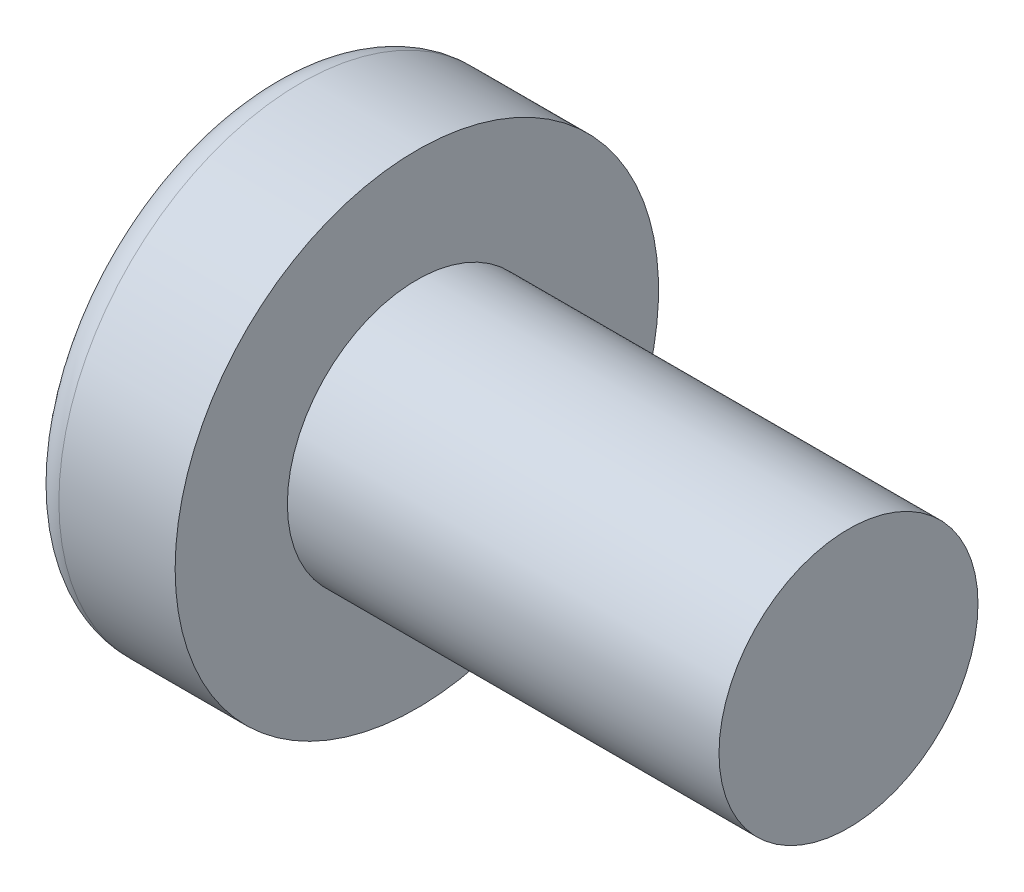
ISO-10303-21;
HEADER;
FILE_DESCRIPTION(('STEP AP214'),'2;1');
FILE_NAME('part.step','',(''),(''),'','','');
FILE_SCHEMA(('AUTOMOTIVE_DESIGN { 1 0 10303 214 1 1 1 1 }'));
ENDSEC;
DATA;
#1=APPLICATION_CONTEXT('core data for automotive mechanical design processes');
#2=APPLICATION_PROTOCOL_DEFINITION('international standard','automotive_design',2000,#1);
#3=PRODUCT_CONTEXT('',#1,'mechanical');
#4=PRODUCT('Part','Part','',(#3));
#5=PRODUCT_RELATED_PRODUCT_CATEGORY('part','',(#4));
#6=PRODUCT_DEFINITION_FORMATION('','',#4);
#7=PRODUCT_DEFINITION_CONTEXT('part definition',#1,'design');
#8=PRODUCT_DEFINITION('design','',#6,#7);
#9=PRODUCT_DEFINITION_SHAPE('','',#8);
#10=(LENGTH_UNIT() NAMED_UNIT(*) SI_UNIT(.MILLI.,.METRE.));
#11=(NAMED_UNIT(*) PLANE_ANGLE_UNIT() SI_UNIT($,.RADIAN.));
#12=(NAMED_UNIT(*) SI_UNIT($,.STERADIAN.) SOLID_ANGLE_UNIT());
#13=UNCERTAINTY_MEASURE_WITH_UNIT(LENGTH_MEASURE(1.E-05),#10,'distance_accuracy_value','');
#14=(GEOMETRIC_REPRESENTATION_CONTEXT(3) GLOBAL_UNCERTAINTY_ASSIGNED_CONTEXT((#13)) GLOBAL_UNIT_ASSIGNED_CONTEXT((#10,
#11,#12)) REPRESENTATION_CONTEXT('',''));
#15=CARTESIAN_POINT('',(0.,0.,0.));
#16=DIRECTION('',(0.,0.,1.));
#17=DIRECTION('',(1.,0.,0.));
#18=AXIS2_PLACEMENT_3D('',#15,#16,#17);
#19=CARTESIAN_POINT('',(5.,0.,0.));
#20=DIRECTION('',(-1.,0.,0.));
#21=DIRECTION('',(0.,1.,0.));
#22=AXIS2_PLACEMENT_3D('',#19,#20,#21);
#23=SPHERICAL_SURFACE('',#22,5.);
#24=CARTESIAN_POINT('',(0.747150706810477,0.,0.));
#25=DIRECTION('',(-1.,0.,0.));
#26=DIRECTION('',(0.,0.,1.));
#27=AXIS2_PLACEMENT_3D('',#24,#25,#26);
#28=CIRCLE('',#27,2.62931034482759);
#29=CARTESIAN_POINT('',(0.747150706810477,0.,2.62931034482759));
#30=VERTEX_POINT('',#29);
#31=EDGE_CURVE('E152',#30,#30,#28,.T.);
#32=ORIENTED_EDGE('',*,*,#31,.T.);
#33=EDGE_LOOP('',(#32));
#34=FACE_BOUND('',#33,.T.);
#35=CARTESIAN_POINT('',(4.98382636322272,-0.153868112043297,0.));
#36=DIRECTION('',(-0.104537710696287,-0.994520923380891,0.));
#37=DIRECTION('',(0.994520923380891,-0.104537710696287,0.));
#38=AXIS2_PLACEMENT_3D('',#35,#36,#37);
#39=CIRCLE('',#38,4.99760572850336);
#40=CARTESIAN_POINT('',(0.188596138461545,0.350175974082162,1.31444652548076));
#41=VERTEX_POINT('',#40);
#42=CARTESIAN_POINT('',(0.0270341343313624,0.367158343834486,0.367158343834487));
#43=VERTEX_POINT('',#42);
#44=EDGE_CURVE('E183',#41,#43,#39,.T.);
#45=ORIENTED_EDGE('',*,*,#44,.F.);
#46=CARTESIAN_POINT('',(3.98403090792016,0.,-1.41352221506761));
#47=DIRECTION('',(0.583636048152575,0.,0.812015371342713));
#48=DIRECTION('',(0.812015371342714,0.,-0.583636048152575));
#49=AXIS2_PLACEMENT_3D('',#46,#47,#48);
#50=CIRCLE('',#49,4.68719124331927);
#51=CARTESIAN_POINT('',(0.188596138461544,-0.350175974082172,1.31444652548076));
#52=VERTEX_POINT('',#51);
#53=EDGE_CURVE('E148',#41,#52,#50,.T.);
#54=ORIENTED_EDGE('',*,*,#53,.T.);
#55=CARTESIAN_POINT('',(4.98382636322272,0.153868112043297,0.));
#56=DIRECTION('',(-0.104537710696287,0.994520923380891,0.));
#57=DIRECTION('',(-0.994520923380891,-0.104537710696287,0.));
#58=AXIS2_PLACEMENT_3D('',#55,#56,#57);
#59=CIRCLE('',#58,4.99760572850336);
#60=CARTESIAN_POINT('',(0.0270341343313616,-0.367158343834489,0.367158343834487));
#61=VERTEX_POINT('',#60);
#62=EDGE_CURVE('E104',#61,#52,#59,.T.);
#63=ORIENTED_EDGE('',*,*,#62,.F.);
#64=CARTESIAN_POINT('',(4.98382636322272,0.,-0.153868112043297));
#65=DIRECTION('',(-0.104537710696287,0.,-0.994520923380891));
#66=DIRECTION('',(-0.994520923380891,0.,0.104537710696287));
#67=AXIS2_PLACEMENT_3D('',#64,#65,#66);
#68=CIRCLE('',#67,4.99760572850336);
#69=CARTESIAN_POINT('',(0.188596138461545,-1.31444652548077,0.350175974082167));
#70=VERTEX_POINT('',#69);
#71=EDGE_CURVE('E129',#70,#61,#68,.T.);
#72=ORIENTED_EDGE('',*,*,#71,.F.);
#73=CARTESIAN_POINT('',(3.98403090792016,1.41352221506761,0.));
#74=DIRECTION('',(0.583636048152575,-0.812015371342713,0.));
#75=DIRECTION('',(0.812015371342714,0.583636048152575,0.));
#76=AXIS2_PLACEMENT_3D('',#73,#74,#75);
#77=CIRCLE('',#76,4.68719124331927);
#78=CARTESIAN_POINT('',(0.188596138461545,-1.31444652548077,-0.350175974082167));
#79=VERTEX_POINT('',#78);
#80=EDGE_CURVE('E137',#70,#79,#77,.T.);
#81=ORIENTED_EDGE('',*,*,#80,.T.);
#82=CARTESIAN_POINT('',(4.98382636322272,0.,0.153868112043297));
#83=DIRECTION('',(-0.104537710696287,0.,0.994520923380891));
#84=DIRECTION('',(0.994520923380891,0.,0.104537710696287));
#85=AXIS2_PLACEMENT_3D('',#82,#83,#84);
#86=CIRCLE('',#85,4.99760572850336);
#87=CARTESIAN_POINT('',(0.0270341343313624,-0.367158343834486,-0.367158343834487));
#88=VERTEX_POINT('',#87);
#89=EDGE_CURVE('E47',#88,#79,#86,.T.);
#90=ORIENTED_EDGE('',*,*,#89,.F.);
#91=CARTESIAN_POINT('',(0.188596138461545,-0.350175974082162,-1.31444652548077));
#92=VERTEX_POINT('',#91);
#93=EDGE_CURVE('E190',#92,#88,#59,.T.);
#94=ORIENTED_EDGE('',*,*,#93,.F.);
#95=CARTESIAN_POINT('',(3.98403090792016,0.,1.41352221506761));
#96=DIRECTION('',(0.583636048152575,0.,-0.812015371342713));
#97=DIRECTION('',(-0.812015371342714,0.,-0.583636048152575));
#98=AXIS2_PLACEMENT_3D('',#95,#96,#97);
#99=CIRCLE('',#98,4.68719124331927);
#100=CARTESIAN_POINT('',(0.188596138461545,0.350175974082172,-1.31444652548076));
#101=VERTEX_POINT('',#100);
#102=EDGE_CURVE('E130',#92,#101,#99,.T.);
#103=ORIENTED_EDGE('',*,*,#102,.T.);
#104=CARTESIAN_POINT('',(0.0270341343313624,0.367158343834489,-0.367158343834487));
#105=VERTEX_POINT('',#104);
#106=EDGE_CURVE('E178',#105,#101,#39,.T.);
#107=ORIENTED_EDGE('',*,*,#106,.F.);
#108=CARTESIAN_POINT('',(0.188596138461546,1.31444652548076,-0.350175974082167));
#109=VERTEX_POINT('',#108);
#110=EDGE_CURVE('E40',#109,#105,#86,.T.);
#111=ORIENTED_EDGE('',*,*,#110,.F.);
#112=CARTESIAN_POINT('',(3.98403090792016,-1.41352221506761,0.));
#113=DIRECTION('',(0.583636048152575,0.812015371342713,0.));
#114=DIRECTION('',(-0.812015371342714,0.583636048152575,0.));
#115=AXIS2_PLACEMENT_3D('',#112,#113,#114);
#116=CIRCLE('',#115,4.68719124331927);
#117=CARTESIAN_POINT('',(0.188596138461546,1.31444652548076,0.350175974082167));
#118=VERTEX_POINT('',#117);
#119=EDGE_CURVE('E11',#109,#118,#116,.T.);
#120=ORIENTED_EDGE('',*,*,#119,.T.);
#121=EDGE_CURVE('E166',#43,#118,#68,.T.);
#122=ORIENTED_EDGE('',*,*,#121,.F.);
#123=EDGE_LOOP('',(#45,#54,#63,#72,#81,#90,#94,#103,#107,#111,#120,#122));
#124=FACE_BOUND('',#123,.T.);
#125=ADVANCED_FACE('F32',(#34,#124),#23,.T.);
#126=CARTESIAN_POINT('',(2.01739130434783,0.,-0.15794466403162));
#127=DIRECTION('',(-0.104537710696287,0.,0.994520923380891));
#128=DIRECTION('',(0.994520923380891,0.,0.104537710696287));
#129=AXIS2_PLACEMENT_3D('',#126,#127,#128);
#130=PLANE('',#129);
#131=ORIENTED_EDGE('',*,*,#110,.T.);
#132=DIRECTION('',(0.989130931836555,-0.103971149085093,0.103971149085092));
#133=VECTOR('',#132,1.);
#134=CARTESIAN_POINT('',(2.03363450411053,0.156237282238383,-0.156237282238382));
#135=LINE('',#134,#133);
#136=CARTESIAN_POINT('',(1.76,0.185000000000001,-0.184999999999999));
#137=VERTEX_POINT('',#136);
#138=EDGE_CURVE('E172',#105,#137,#135,.T.);
#139=ORIENTED_EDGE('',*,*,#138,.T.);
#140=DIRECTION('',(0.80907355338853,-0.581521616498006,0.0850446632823171));
#141=VECTOR('',#140,1.);
#142=CARTESIAN_POINT('',(0.,1.45,-0.37));
#143=LINE('',#142,#141);
#144=EDGE_CURVE('E153',#109,#137,#143,.T.);
#145=ORIENTED_EDGE('',*,*,#144,.F.);
#146=EDGE_LOOP('',(#131,#139,#145));
#147=FACE_BOUND('',#146,.T.);
#148=ADVANCED_FACE('F171',(#147),#130,.T.);
#149=DIRECTION('',(0.80907355338853,0.581521616498006,0.0850446632823171));
#150=VECTOR('',#149,1.);
#151=CARTESIAN_POINT('',(0.,-1.45,-0.37));
#152=LINE('',#151,#150);
#153=CARTESIAN_POINT('',(1.76,-0.185,-0.185));
#154=VERTEX_POINT('',#153);
#155=EDGE_CURVE('E138',#79,#154,#152,.T.);
#156=ORIENTED_EDGE('',*,*,#155,.T.);
#157=DIRECTION('',(-0.989130931836555,-0.103971149085092,-0.103971149085092));
#158=VECTOR('',#157,1.);
#159=CARTESIAN_POINT('',(2.03363450411053,-0.156237282238382,-0.156237282238382));
#160=LINE('',#159,#158);
#161=EDGE_CURVE('E193',#154,#88,#160,.T.);
#162=ORIENTED_EDGE('',*,*,#161,.T.);
#163=ORIENTED_EDGE('',*,*,#89,.T.);
#164=EDGE_LOOP('',(#156,#162,#163));
#165=FACE_BOUND('',#164,.T.);
#166=ADVANCED_FACE('F208',(#165),#130,.T.);
#167=CARTESIAN_POINT('',(2.01739130434783,0.,0.15794466403162));
#168=DIRECTION('',(-0.104537710696287,0.,-0.994520923380891));
#169=DIRECTION('',(-0.994520923380891,0.,0.104537710696287));
#170=AXIS2_PLACEMENT_3D('',#167,#168,#169);
#171=PLANE('',#170);
#172=DIRECTION('',(0.80907355338853,-0.581521616498006,-0.0850446632823171));
#173=VECTOR('',#172,1.);
#174=CARTESIAN_POINT('',(0.,1.45,0.37));
#175=LINE('',#174,#173);
#176=CARTESIAN_POINT('',(1.76,0.185,0.185));
#177=VERTEX_POINT('',#176);
#178=EDGE_CURVE('E209',#118,#177,#175,.T.);
#179=ORIENTED_EDGE('',*,*,#178,.T.);
#180=DIRECTION('',(-0.989130931836555,0.103971149085092,0.103971149085092));
#181=VECTOR('',#180,1.);
#182=CARTESIAN_POINT('',(2.03363450411053,0.156237282238382,0.156237282238382));
#183=LINE('',#182,#181);
#184=EDGE_CURVE('E187',#177,#43,#183,.T.);
#185=ORIENTED_EDGE('',*,*,#184,.T.);
#186=ORIENTED_EDGE('',*,*,#121,.T.);
#187=EDGE_LOOP('',(#179,#185,#186));
#188=FACE_BOUND('',#187,.T.);
#189=ADVANCED_FACE('F213',(#188),#171,.T.);
#190=ORIENTED_EDGE('',*,*,#71,.T.);
#191=DIRECTION('',(0.989130931836555,0.103971149085093,-0.103971149085092));
#192=VECTOR('',#191,1.);
#193=CARTESIAN_POINT('',(2.03363450411053,-0.156237282238383,0.156237282238382));
#194=LINE('',#193,#192);
#195=CARTESIAN_POINT('',(1.76,-0.185000000000001,0.184999999999999));
#196=VERTEX_POINT('',#195);
#197=EDGE_CURVE('E102',#61,#196,#194,.T.);
#198=ORIENTED_EDGE('',*,*,#197,.T.);
#199=DIRECTION('',(0.80907355338853,0.581521616498006,-0.085044663282317));
#200=VECTOR('',#199,1.);
#201=CARTESIAN_POINT('',(0.,-1.45,0.37));
#202=LINE('',#201,#200);
#203=EDGE_CURVE('E127',#70,#196,#202,.T.);
#204=ORIENTED_EDGE('',*,*,#203,.F.);
#205=EDGE_LOOP('',(#190,#198,#204));
#206=FACE_BOUND('',#205,.T.);
#207=ADVANCED_FACE('F126',(#206),#171,.T.);
#208=CARTESIAN_POINT('',(-25.4,0.,0.));
#209=DIRECTION('',(-1.,0.,0.));
#210=DIRECTION('',(0.,0.,1.));
#211=AXIS2_PLACEMENT_3D('',#208,#209,#210);
#212=CYLINDRICAL_SURFACE('',#211,1.5);
#213=CARTESIAN_POINT('',(7.4,0.,0.));
#214=DIRECTION('',(-1.,0.,0.));
#215=DIRECTION('',(0.,0.,1.));
#216=AXIS2_PLACEMENT_3D('',#213,#214,#215);
#217=CIRCLE('',#216,1.5);
#218=CARTESIAN_POINT('',(7.4,0.,1.5));
#219=VERTEX_POINT('',#218);
#220=EDGE_CURVE('E149',#219,#219,#217,.T.);
#221=ORIENTED_EDGE('',*,*,#220,.T.);
#222=EDGE_LOOP('',(#221));
#223=FACE_BOUND('',#222,.T.);
#224=CARTESIAN_POINT('',(2.4,0.,0.));
#225=DIRECTION('',(-1.,0.,0.));
#226=DIRECTION('',(0.,0.,1.));
#227=AXIS2_PLACEMENT_3D('',#224,#225,#226);
#228=CIRCLE('',#227,1.5);
#229=CARTESIAN_POINT('',(2.4,0.,1.5));
#230=VERTEX_POINT('',#229);
#231=EDGE_CURVE('E162',#230,#230,#228,.T.);
#232=ORIENTED_EDGE('',*,*,#231,.F.);
#233=EDGE_LOOP('',(#232));
#234=FACE_BOUND('',#233,.T.);
#235=ADVANCED_FACE('F34',(#223,#234),#212,.T.);
#236=CARTESIAN_POINT('',(2.4,1.5,0.));
#237=DIRECTION('',(-1.,0.,0.));
#238=DIRECTION('',(0.,0.,1.));
#239=AXIS2_PLACEMENT_3D('',#236,#237,#238);
#240=PLANE('',#239);
#241=CARTESIAN_POINT('',(2.4,0.,0.));
#242=DIRECTION('',(-1.,0.,0.));
#243=DIRECTION('',(0.,0.,1.));
#244=AXIS2_PLACEMENT_3D('',#241,#242,#243);
#245=CIRCLE('',#244,2.8);
#246=CARTESIAN_POINT('',(2.4,0.,2.8));
#247=VERTEX_POINT('',#246);
#248=EDGE_CURVE('E159',#247,#247,#245,.T.);
#249=ORIENTED_EDGE('',*,*,#248,.F.);
#250=EDGE_LOOP('',(#249));
#251=FACE_BOUND('',#250,.T.);
#252=ORIENTED_EDGE('',*,*,#231,.T.);
#253=EDGE_LOOP('',(#252));
#254=FACE_BOUND('',#253,.T.);
#255=ADVANCED_FACE('F241',(#251,#254),#240,.F.);
#256=CARTESIAN_POINT('',(-25.4,0.,0.));
#257=DIRECTION('',(-1.,0.,0.));
#258=DIRECTION('',(0.,0.,1.));
#259=AXIS2_PLACEMENT_3D('',#256,#257,#258);
#260=CYLINDRICAL_SURFACE('',#259,2.8);
#261=ORIENTED_EDGE('',*,*,#248,.T.);
#262=EDGE_LOOP('',(#261));
#263=FACE_BOUND('',#262,.T.);
#264=CARTESIAN_POINT('',(1.05335585592012,0.,0.));
#265=DIRECTION('',(-1.,0.,0.));
#266=DIRECTION('',(0.,0.,1.));
#267=AXIS2_PLACEMENT_3D('',#264,#265,#266);
#268=CIRCLE('',#267,2.8);
#269=CARTESIAN_POINT('',(1.05335585592012,0.,2.8));
#270=VERTEX_POINT('',#269);
#271=EDGE_CURVE('E156',#270,#270,#268,.T.);
#272=ORIENTED_EDGE('',*,*,#271,.F.);
#273=EDGE_LOOP('',(#272));
#274=FACE_BOUND('',#273,.T.);
#275=ADVANCED_FACE('F238',(#263,#274),#260,.T.);
#276=CARTESIAN_POINT('',(1.05335585592012,0.,0.));
#277=DIRECTION('',(-1.,0.,0.));
#278=DIRECTION('',(0.,0.,1.));
#279=AXIS2_PLACEMENT_3D('',#276,#277,#278);
#280=TOROIDAL_SURFACE('',#279,2.44,0.36);
#281=ORIENTED_EDGE('',*,*,#271,.T.);
#282=EDGE_LOOP('',(#281));
#283=FACE_BOUND('',#282,.T.);
#284=ORIENTED_EDGE('',*,*,#31,.F.);
#285=EDGE_LOOP('',(#284));
#286=FACE_BOUND('',#285,.T.);
#287=ADVANCED_FACE('F235',(#283,#286),#280,.T.);
#288=CARTESIAN_POINT('',(7.4,1.5,0.));
#289=DIRECTION('',(1.,0.,0.));
#290=DIRECTION('',(0.,0.,-1.));
#291=AXIS2_PLACEMENT_3D('',#288,#289,#290);
#292=PLANE('',#291);
#293=ORIENTED_EDGE('',*,*,#220,.F.);
#294=EDGE_LOOP('',(#293));
#295=FACE_BOUND('',#294,.T.);
#296=ADVANCED_FACE('F233',(#295),#292,.T.);
#297=CARTESIAN_POINT('',(1.76,0.185,0.185));
#298=DIRECTION('',(0.583636048152575,0.812015371342713,0.));
#299=DIRECTION('',(-0.812015371342714,0.583636048152575,0.));
#300=AXIS2_PLACEMENT_3D('',#297,#298,#299);
#301=PLANE('',#300);
#302=ORIENTED_EDGE('',*,*,#144,.T.);
#303=DIRECTION('',(0.,0.,-1.));
#304=VECTOR('',#303,1.);
#305=CARTESIAN_POINT('',(1.76,0.185,0.185));
#306=LINE('',#305,#304);
#307=EDGE_CURVE('E120',#177,#137,#306,.T.);
#308=ORIENTED_EDGE('',*,*,#307,.F.);
#309=ORIENTED_EDGE('',*,*,#178,.F.);
#310=ORIENTED_EDGE('',*,*,#119,.F.);
#311=EDGE_LOOP('',(#302,#308,#309,#310));
#312=FACE_BOUND('',#311,.T.);
#313=ADVANCED_FACE('F212',(#312),#301,.F.);
#314=CARTESIAN_POINT('',(1.76,-0.185,-0.185));
#315=DIRECTION('',(0.583636048152575,-0.812015371342713,0.));
#316=DIRECTION('',(0.812015371342714,0.583636048152575,0.));
#317=AXIS2_PLACEMENT_3D('',#314,#315,#316);
#318=PLANE('',#317);
#319=ORIENTED_EDGE('',*,*,#203,.T.);
#320=DIRECTION('',(0.,0.,1.));
#321=VECTOR('',#320,1.);
#322=CARTESIAN_POINT('',(1.76,-0.185,-0.185));
#323=LINE('',#322,#321);
#324=EDGE_CURVE('E119',#154,#196,#323,.T.);
#325=ORIENTED_EDGE('',*,*,#324,.F.);
#326=ORIENTED_EDGE('',*,*,#155,.F.);
#327=ORIENTED_EDGE('',*,*,#80,.F.);
#328=EDGE_LOOP('',(#319,#325,#326,#327));
#329=FACE_BOUND('',#328,.T.);
#330=ADVANCED_FACE('F134',(#329),#318,.F.);
#331=CARTESIAN_POINT('',(1.76,-0.185,-0.185));
#332=DIRECTION('',(1.,0.,0.));
#333=DIRECTION('',(0.,0.,-1.));
#334=AXIS2_PLACEMENT_3D('',#331,#332,#333);
#335=PLANE('',#334);
#336=DIRECTION('',(0.,1.,0.));
#337=VECTOR('',#336,1.);
#338=CARTESIAN_POINT('',(1.76,-0.185,-0.185));
#339=LINE('',#338,#337);
#340=EDGE_CURVE('E142',#154,#137,#339,.T.);
#341=ORIENTED_EDGE('',*,*,#340,.F.);
#342=ORIENTED_EDGE('',*,*,#324,.T.);
#343=DIRECTION('',(0.,-1.,0.));
#344=VECTOR('',#343,1.);
#345=CARTESIAN_POINT('',(1.76,0.185,0.185));
#346=LINE('',#345,#344);
#347=EDGE_CURVE('E111',#177,#196,#346,.T.);
#348=ORIENTED_EDGE('',*,*,#347,.F.);
#349=ORIENTED_EDGE('',*,*,#307,.T.);
#350=EDGE_LOOP('',(#341,#342,#348,#349));
#351=FACE_BOUND('',#350,.T.);
#352=ADVANCED_FACE('F140',(#351),#335,.F.);
#353=CARTESIAN_POINT('',(1.76,0.185000000000001,-0.184999999999999));
#354=DIRECTION('',(0.583636048152575,0.,-0.812015371342713));
#355=DIRECTION('',(0.812015371342714,0.,0.583636048152575));
#356=AXIS2_PLACEMENT_3D('',#353,#354,#355);
#357=PLANE('',#356);
#358=DIRECTION('',(0.80907355338853,0.085044663282315,0.581521616498006));
#359=VECTOR('',#358,1.);
#360=CARTESIAN_POINT('',(0.,-0.369999999999995,-1.45));
#361=LINE('',#360,#359);
#362=EDGE_CURVE('E198',#92,#154,#361,.T.);
#363=ORIENTED_EDGE('',*,*,#362,.T.);
#364=ORIENTED_EDGE('',*,*,#340,.T.);
#365=DIRECTION('',(0.80907355338853,-0.0850446632823191,0.581521616498006));
#366=VECTOR('',#365,1.);
#367=CARTESIAN_POINT('',(0.,0.370000000000005,-1.45));
#368=LINE('',#367,#366);
#369=EDGE_CURVE('E108',#101,#137,#368,.T.);
#370=ORIENTED_EDGE('',*,*,#369,.F.);
#371=ORIENTED_EDGE('',*,*,#102,.F.);
#372=EDGE_LOOP('',(#363,#364,#370,#371));
#373=FACE_BOUND('',#372,.T.);
#374=ADVANCED_FACE('F203',(#373),#357,.F.);
#375=CARTESIAN_POINT('',(2.01739130434783,-0.15794466403162,0.));
#376=DIRECTION('',(-0.104537710696287,0.994520923380891,0.));
#377=DIRECTION('',(-0.994520923380891,-0.104537710696287,0.));
#378=AXIS2_PLACEMENT_3D('',#375,#376,#377);
#379=PLANE('',#378);
#380=ORIENTED_EDGE('',*,*,#93,.T.);
#381=ORIENTED_EDGE('',*,*,#161,.F.);
#382=ORIENTED_EDGE('',*,*,#362,.F.);
#383=EDGE_LOOP('',(#380,#381,#382));
#384=FACE_BOUND('',#383,.T.);
#385=ADVANCED_FACE('F207',(#384),#379,.T.);
#386=CARTESIAN_POINT('',(2.01739130434783,0.15794466403162,0.));
#387=DIRECTION('',(-0.104537710696287,-0.994520923380891,0.));
#388=DIRECTION('',(0.994520923380891,-0.104537710696287,0.));
#389=AXIS2_PLACEMENT_3D('',#386,#387,#388);
#390=PLANE('',#389);
#391=ORIENTED_EDGE('',*,*,#106,.T.);
#392=ORIENTED_EDGE('',*,*,#369,.T.);
#393=ORIENTED_EDGE('',*,*,#138,.F.);
#394=EDGE_LOOP('',(#391,#392,#393));
#395=FACE_BOUND('',#394,.T.);
#396=ADVANCED_FACE('F201',(#395),#390,.T.);
#397=CARTESIAN_POINT('',(1.76,-0.185000000000001,0.184999999999999));
#398=DIRECTION('',(0.583636048152575,0.,0.812015371342713));
#399=DIRECTION('',(-0.812015371342714,0.,0.583636048152575));
#400=AXIS2_PLACEMENT_3D('',#397,#398,#399);
#401=PLANE('',#400);
#402=DIRECTION('',(0.80907355338853,-0.0850446632823151,-0.581521616498006));
#403=VECTOR('',#402,1.);
#404=CARTESIAN_POINT('',(0.,0.369999999999995,1.45));
#405=LINE('',#404,#403);
#406=EDGE_CURVE('E107',#41,#177,#405,.T.);
#407=ORIENTED_EDGE('',*,*,#406,.T.);
#408=ORIENTED_EDGE('',*,*,#347,.T.);
#409=DIRECTION('',(0.80907355338853,0.0850446632823191,-0.581521616498006));
#410=VECTOR('',#409,1.);
#411=CARTESIAN_POINT('',(0.,-0.370000000000005,1.45));
#412=LINE('',#411,#410);
#413=EDGE_CURVE('E98',#52,#196,#412,.T.);
#414=ORIENTED_EDGE('',*,*,#413,.F.);
#415=ORIENTED_EDGE('',*,*,#53,.F.);
#416=EDGE_LOOP('',(#407,#408,#414,#415));
#417=FACE_BOUND('',#416,.T.);
#418=ADVANCED_FACE('F112',(#417),#401,.F.);
#419=ORIENTED_EDGE('',*,*,#44,.T.);
#420=ORIENTED_EDGE('',*,*,#184,.F.);
#421=ORIENTED_EDGE('',*,*,#406,.F.);
#422=EDGE_LOOP('',(#419,#420,#421));
#423=FACE_BOUND('',#422,.T.);
#424=ADVANCED_FACE('F214',(#423),#390,.T.);
#425=ORIENTED_EDGE('',*,*,#62,.T.);
#426=ORIENTED_EDGE('',*,*,#413,.T.);
#427=ORIENTED_EDGE('',*,*,#197,.F.);
#428=EDGE_LOOP('',(#425,#426,#427));
#429=FACE_BOUND('',#428,.T.);
#430=ADVANCED_FACE('F100',(#429),#379,.T.);
#431=CLOSED_SHELL('',(#125,#148,#166,#189,#207,#235,#255,#275,#287,#296,#313,#330,#352,#374,
#385,#396,#418,#424,#430));
#432=MANIFOLD_SOLID_BREP('B2',#431);
#433=ADVANCED_BREP_SHAPE_REPRESENTATION('',(#18,#432),#14);
#434=SHAPE_DEFINITION_REPRESENTATION(#9,#433);
ENDSEC;
END-ISO-10303-21;
